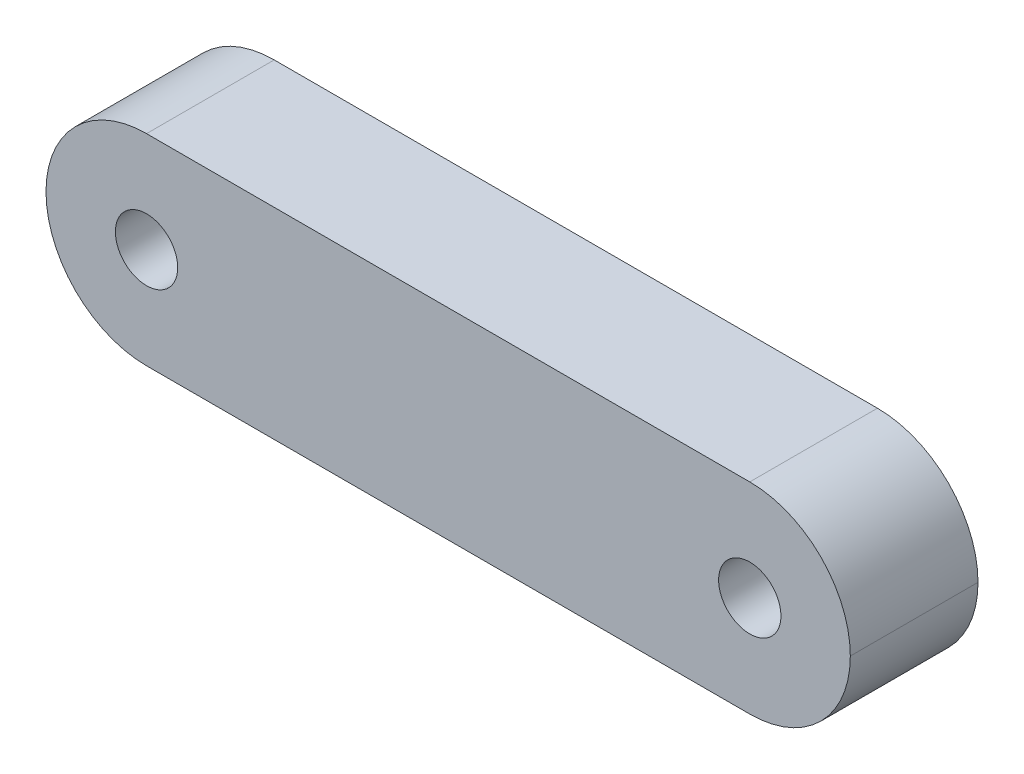
ISO-10303-21;
HEADER;
FILE_DESCRIPTION(('STEP AP214'),'2;1');
FILE_NAME('part.step','',(''),(''),'','','');
FILE_SCHEMA(('AUTOMOTIVE_DESIGN { 1 0 10303 214 1 1 1 1 }'));
ENDSEC;
DATA;
#1=APPLICATION_CONTEXT('core data for automotive mechanical design processes');
#2=APPLICATION_PROTOCOL_DEFINITION('international standard','automotive_design',2000,#1);
#3=PRODUCT_CONTEXT('',#1,'mechanical');
#4=PRODUCT('Part','Part','',(#3));
#5=PRODUCT_RELATED_PRODUCT_CATEGORY('part','',(#4));
#6=PRODUCT_DEFINITION_FORMATION('','',#4);
#7=PRODUCT_DEFINITION_CONTEXT('part definition',#1,'design');
#8=PRODUCT_DEFINITION('design','',#6,#7);
#9=PRODUCT_DEFINITION_SHAPE('','',#8);
#10=(LENGTH_UNIT() NAMED_UNIT(*) SI_UNIT(.MILLI.,.METRE.));
#11=(NAMED_UNIT(*) PLANE_ANGLE_UNIT() SI_UNIT($,.RADIAN.));
#12=(NAMED_UNIT(*) SI_UNIT($,.STERADIAN.) SOLID_ANGLE_UNIT());
#13=UNCERTAINTY_MEASURE_WITH_UNIT(LENGTH_MEASURE(1.E-05),#10,'distance_accuracy_value','');
#14=(GEOMETRIC_REPRESENTATION_CONTEXT(3) GLOBAL_UNCERTAINTY_ASSIGNED_CONTEXT((#13)) GLOBAL_UNIT_ASSIGNED_CONTEXT((#10,
#11,#12)) REPRESENTATION_CONTEXT('',''));
#15=CARTESIAN_POINT('',(0.,0.,0.));
#16=DIRECTION('',(0.,0.,1.));
#17=DIRECTION('',(1.,0.,0.));
#18=AXIS2_PLACEMENT_3D('',#15,#16,#17);
#19=CARTESIAN_POINT('',(0.,0.,6.35));
#20=DIRECTION('',(0.,1.,0.));
#21=DIRECTION('',(0.,0.,1.));
#22=AXIS2_PLACEMENT_3D('',#19,#20,#21);
#23=PLANE('',#22);
#24=DIRECTION('',(1.,0.,0.));
#25=VECTOR('',#24,1.);
#26=CARTESIAN_POINT('',(0.,0.,6.35));
#27=LINE('',#26,#25);
#28=CARTESIAN_POINT('',(5.,0.,6.35));
#29=VERTEX_POINT('',#28);
#30=CARTESIAN_POINT('',(35.,0.,6.35));
#31=VERTEX_POINT('',#30);
#32=EDGE_CURVE('E96',#29,#31,#27,.T.);
#33=ORIENTED_EDGE('',*,*,#32,.F.);
#34=DIRECTION('',(0.,0.,-1.));
#35=VECTOR('',#34,1.);
#36=CARTESIAN_POINT('',(5.,0.,0.));
#37=LINE('',#36,#35);
#38=CARTESIAN_POINT('',(5.,0.,0.));
#39=VERTEX_POINT('',#38);
#40=EDGE_CURVE('E11',#29,#39,#37,.T.);
#41=ORIENTED_EDGE('',*,*,#40,.T.);
#42=DIRECTION('',(1.,0.,0.));
#43=VECTOR('',#42,1.);
#44=CARTESIAN_POINT('',(0.,0.,0.));
#45=LINE('',#44,#43);
#46=CARTESIAN_POINT('',(35.,0.,0.));
#47=VERTEX_POINT('',#46);
#48=EDGE_CURVE('E94',#39,#47,#45,.T.);
#49=ORIENTED_EDGE('',*,*,#48,.T.);
#50=DIRECTION('',(0.,0.,-1.));
#51=VECTOR('',#50,1.);
#52=CARTESIAN_POINT('',(35.,0.,6.35));
#53=LINE('',#52,#51);
#54=EDGE_CURVE('E47',#47,#31,#53,.F.);
#55=ORIENTED_EDGE('',*,*,#54,.T.);
#56=EDGE_LOOP('',(#33,#41,#49,#55));
#57=FACE_BOUND('',#56,.T.);
#58=ADVANCED_FACE('F38',(#57),#23,.F.);
#59=CARTESIAN_POINT('',(0.,10.,6.35));
#60=DIRECTION('',(0.,1.,0.));
#61=DIRECTION('',(0.,0.,1.));
#62=AXIS2_PLACEMENT_3D('',#59,#60,#61);
#63=PLANE('',#62);
#64=DIRECTION('',(1.,0.,0.));
#65=VECTOR('',#64,1.);
#66=CARTESIAN_POINT('',(0.,10.,0.));
#67=LINE('',#66,#65);
#68=CARTESIAN_POINT('',(5.,10.,0.));
#69=VERTEX_POINT('',#68);
#70=CARTESIAN_POINT('',(35.,10.,0.));
#71=VERTEX_POINT('',#70);
#72=EDGE_CURVE('E105',#69,#71,#67,.T.);
#73=ORIENTED_EDGE('',*,*,#72,.F.);
#74=DIRECTION('',(0.,0.,-1.));
#75=VECTOR('',#74,1.);
#76=CARTESIAN_POINT('',(5.,10.,6.35));
#77=LINE('',#76,#75);
#78=CARTESIAN_POINT('',(5.,10.,6.35));
#79=VERTEX_POINT('',#78);
#80=EDGE_CURVE('E122',#69,#79,#77,.F.);
#81=ORIENTED_EDGE('',*,*,#80,.T.);
#82=DIRECTION('',(1.,0.,0.));
#83=VECTOR('',#82,1.);
#84=CARTESIAN_POINT('',(0.,10.,6.35));
#85=LINE('',#84,#83);
#86=CARTESIAN_POINT('',(35.,10.,6.35));
#87=VERTEX_POINT('',#86);
#88=EDGE_CURVE('E141',#79,#87,#85,.T.);
#89=ORIENTED_EDGE('',*,*,#88,.T.);
#90=DIRECTION('',(0.,0.,-1.));
#91=VECTOR('',#90,1.);
#92=CARTESIAN_POINT('',(35.,10.,0.));
#93=LINE('',#92,#91);
#94=EDGE_CURVE('E115',#87,#71,#93,.T.);
#95=ORIENTED_EDGE('',*,*,#94,.T.);
#96=EDGE_LOOP('',(#73,#81,#89,#95));
#97=FACE_BOUND('',#96,.T.);
#98=ADVANCED_FACE('F167',(#97),#63,.T.);
#99=CARTESIAN_POINT('',(35.,5.,6.35));
#100=DIRECTION('',(0.,0.,-1.));
#101=DIRECTION('',(-1.,0.,0.));
#102=AXIS2_PLACEMENT_3D('',#99,#100,#101);
#103=CYLINDRICAL_SURFACE('',#102,1.55);
#104=CARTESIAN_POINT('',(35.,5.,6.35));
#105=DIRECTION('',(0.,0.,1.));
#106=DIRECTION('',(1.,0.,0.));
#107=AXIS2_PLACEMENT_3D('',#104,#105,#106);
#108=CIRCLE('',#107,1.55);
#109=CARTESIAN_POINT('',(36.55,5.,6.35));
#110=VERTEX_POINT('',#109);
#111=EDGE_CURVE('E151',#110,#110,#108,.T.);
#112=ORIENTED_EDGE('',*,*,#111,.T.);
#113=EDGE_LOOP('',(#112));
#114=FACE_BOUND('',#113,.T.);
#115=CARTESIAN_POINT('',(35.,5.,0.));
#116=DIRECTION('',(0.,0.,1.));
#117=DIRECTION('',(1.,0.,0.));
#118=AXIS2_PLACEMENT_3D('',#115,#116,#117);
#119=CIRCLE('',#118,1.55);
#120=CARTESIAN_POINT('',(36.55,5.,0.));
#121=VERTEX_POINT('',#120);
#122=EDGE_CURVE('E106',#121,#121,#119,.T.);
#123=ORIENTED_EDGE('',*,*,#122,.F.);
#124=EDGE_LOOP('',(#123));
#125=FACE_BOUND('',#124,.T.);
#126=ADVANCED_FACE('F183',(#114,#125),#103,.F.);
#127=CARTESIAN_POINT('',(5.,5.,6.35));
#128=DIRECTION('',(0.,0.,-1.));
#129=DIRECTION('',(-1.,0.,0.));
#130=AXIS2_PLACEMENT_3D('',#127,#128,#129);
#131=CYLINDRICAL_SURFACE('',#130,1.55);
#132=CARTESIAN_POINT('',(5.,5.,6.35));
#133=DIRECTION('',(0.,0.,1.));
#134=DIRECTION('',(1.,0.,0.));
#135=AXIS2_PLACEMENT_3D('',#132,#133,#134);
#136=CIRCLE('',#135,1.55);
#137=CARTESIAN_POINT('',(6.55,5.,6.35));
#138=VERTEX_POINT('',#137);
#139=EDGE_CURVE('E146',#138,#138,#136,.T.);
#140=ORIENTED_EDGE('',*,*,#139,.T.);
#141=EDGE_LOOP('',(#140));
#142=FACE_BOUND('',#141,.T.);
#143=CARTESIAN_POINT('',(5.,5.,0.));
#144=DIRECTION('',(0.,0.,1.));
#145=DIRECTION('',(1.,0.,0.));
#146=AXIS2_PLACEMENT_3D('',#143,#144,#145);
#147=CIRCLE('',#146,1.55);
#148=CARTESIAN_POINT('',(6.55,5.,0.));
#149=VERTEX_POINT('',#148);
#150=EDGE_CURVE('E131',#149,#149,#147,.T.);
#151=ORIENTED_EDGE('',*,*,#150,.F.);
#152=EDGE_LOOP('',(#151));
#153=FACE_BOUND('',#152,.T.);
#154=ADVANCED_FACE('F157',(#142,#153),#131,.F.);
#155=CARTESIAN_POINT('',(0.,0.,6.35));
#156=DIRECTION('',(0.,0.,1.));
#157=DIRECTION('',(1.,0.,0.));
#158=AXIS2_PLACEMENT_3D('',#155,#156,#157);
#159=PLANE('',#158);
#160=ORIENTED_EDGE('',*,*,#139,.F.);
#161=EDGE_LOOP('',(#160));
#162=FACE_BOUND('',#161,.T.);
#163=ORIENTED_EDGE('',*,*,#111,.F.);
#164=EDGE_LOOP('',(#163));
#165=FACE_BOUND('',#164,.T.);
#166=ORIENTED_EDGE('',*,*,#88,.F.);
#167=CARTESIAN_POINT('',(5.,5.,6.35));
#168=DIRECTION('',(0.,0.,1.));
#169=DIRECTION('',(1.,0.,0.));
#170=AXIS2_PLACEMENT_3D('',#167,#168,#169);
#171=CIRCLE('',#170,5.);
#172=CARTESIAN_POINT('',(0.,5.,6.35));
#173=VERTEX_POINT('',#172);
#174=EDGE_CURVE('E55',#79,#173,#171,.T.);
#175=ORIENTED_EDGE('',*,*,#174,.T.);
#176=CARTESIAN_POINT('',(5.,5.,6.35));
#177=DIRECTION('',(0.,0.,1.));
#178=DIRECTION('',(1.,0.,0.));
#179=AXIS2_PLACEMENT_3D('',#176,#177,#178);
#180=CIRCLE('',#179,5.);
#181=EDGE_CURVE('E128',#173,#29,#180,.T.);
#182=ORIENTED_EDGE('',*,*,#181,.T.);
#183=ORIENTED_EDGE('',*,*,#32,.T.);
#184=CARTESIAN_POINT('',(35.,5.,6.35));
#185=DIRECTION('',(0.,0.,1.));
#186=DIRECTION('',(1.,0.,0.));
#187=AXIS2_PLACEMENT_3D('',#184,#185,#186);
#188=CIRCLE('',#187,5.);
#189=CARTESIAN_POINT('',(40.,5.,6.35));
#190=VERTEX_POINT('',#189);
#191=EDGE_CURVE('E62',#31,#190,#188,.T.);
#192=ORIENTED_EDGE('',*,*,#191,.T.);
#193=CARTESIAN_POINT('',(35.,5.,6.35));
#194=DIRECTION('',(0.,0.,1.));
#195=DIRECTION('',(1.,0.,0.));
#196=AXIS2_PLACEMENT_3D('',#193,#194,#195);
#197=CIRCLE('',#196,5.);
#198=EDGE_CURVE('E126',#190,#87,#197,.T.);
#199=ORIENTED_EDGE('',*,*,#198,.T.);
#200=EDGE_LOOP('',(#166,#175,#182,#183,#192,#199));
#201=FACE_BOUND('',#200,.T.);
#202=ADVANCED_FACE('F160',(#162,#165,#201),#159,.T.);
#203=CARTESIAN_POINT('',(0.,0.,0.));
#204=DIRECTION('',(0.,0.,1.));
#205=DIRECTION('',(1.,0.,0.));
#206=AXIS2_PLACEMENT_3D('',#203,#204,#205);
#207=PLANE('',#206);
#208=ORIENTED_EDGE('',*,*,#150,.T.);
#209=EDGE_LOOP('',(#208));
#210=FACE_BOUND('',#209,.T.);
#211=ORIENTED_EDGE('',*,*,#122,.T.);
#212=EDGE_LOOP('',(#211));
#213=FACE_BOUND('',#212,.T.);
#214=CARTESIAN_POINT('',(5.,5.,0.));
#215=DIRECTION('',(0.,0.,1.));
#216=DIRECTION('',(1.,0.,0.));
#217=AXIS2_PLACEMENT_3D('',#214,#215,#216);
#218=CIRCLE('',#217,5.);
#219=CARTESIAN_POINT('',(0.,5.,0.));
#220=VERTEX_POINT('',#219);
#221=EDGE_CURVE('E101',#39,#220,#218,.F.);
#222=ORIENTED_EDGE('',*,*,#221,.T.);
#223=CARTESIAN_POINT('',(5.,5.,0.));
#224=DIRECTION('',(0.,0.,1.));
#225=DIRECTION('',(1.,0.,0.));
#226=AXIS2_PLACEMENT_3D('',#223,#224,#225);
#227=CIRCLE('',#226,5.);
#228=EDGE_CURVE('E112',#220,#69,#227,.F.);
#229=ORIENTED_EDGE('',*,*,#228,.T.);
#230=ORIENTED_EDGE('',*,*,#72,.T.);
#231=CARTESIAN_POINT('',(35.,5.,0.));
#232=DIRECTION('',(0.,0.,1.));
#233=DIRECTION('',(1.,0.,0.));
#234=AXIS2_PLACEMENT_3D('',#231,#232,#233);
#235=CIRCLE('',#234,5.);
#236=CARTESIAN_POINT('',(40.,5.,0.));
#237=VERTEX_POINT('',#236);
#238=EDGE_CURVE('E113',#71,#237,#235,.F.);
#239=ORIENTED_EDGE('',*,*,#238,.T.);
#240=CARTESIAN_POINT('',(35.,5.,0.));
#241=DIRECTION('',(0.,0.,1.));
#242=DIRECTION('',(1.,0.,0.));
#243=AXIS2_PLACEMENT_3D('',#240,#241,#242);
#244=CIRCLE('',#243,5.);
#245=EDGE_CURVE('E104',#237,#47,#244,.F.);
#246=ORIENTED_EDGE('',*,*,#245,.T.);
#247=ORIENTED_EDGE('',*,*,#48,.F.);
#248=EDGE_LOOP('',(#222,#229,#230,#239,#246,#247));
#249=FACE_BOUND('',#248,.T.);
#250=ADVANCED_FACE('F100',(#210,#213,#249),#207,.F.);
#251=CARTESIAN_POINT('',(5.,5.,6.35));
#252=DIRECTION('',(0.,0.,1.));
#253=DIRECTION('',(1.,0.,0.));
#254=AXIS2_PLACEMENT_3D('',#251,#252,#253);
#255=CYLINDRICAL_SURFACE('',#254,5.);
#256=ORIENTED_EDGE('',*,*,#40,.F.);
#257=ORIENTED_EDGE('',*,*,#181,.F.);
#258=DIRECTION('',(0.,0.,-1.));
#259=VECTOR('',#258,1.);
#260=CARTESIAN_POINT('',(0.,5.,6.35));
#261=LINE('',#260,#259);
#262=EDGE_CURVE('E110',#220,#173,#261,.F.);
#263=ORIENTED_EDGE('',*,*,#262,.F.);
#264=ORIENTED_EDGE('',*,*,#221,.F.);
#265=EDGE_LOOP('',(#256,#257,#263,#264));
#266=FACE_BOUND('',#265,.T.);
#267=ADVANCED_FACE('F108',(#266),#255,.T.);
#268=CARTESIAN_POINT('',(5.,5.,6.35));
#269=DIRECTION('',(0.,0.,-1.));
#270=DIRECTION('',(-1.,0.,0.));
#271=AXIS2_PLACEMENT_3D('',#268,#269,#270);
#272=CYLINDRICAL_SURFACE('',#271,5.);
#273=ORIENTED_EDGE('',*,*,#174,.F.);
#274=ORIENTED_EDGE('',*,*,#80,.F.);
#275=ORIENTED_EDGE('',*,*,#228,.F.);
#276=ORIENTED_EDGE('',*,*,#262,.T.);
#277=EDGE_LOOP('',(#273,#274,#275,#276));
#278=FACE_BOUND('',#277,.T.);
#279=ADVANCED_FACE('F169',(#278),#272,.T.);
#280=CARTESIAN_POINT('',(35.,5.,6.35));
#281=DIRECTION('',(0.,0.,-1.));
#282=DIRECTION('',(-1.,0.,0.));
#283=AXIS2_PLACEMENT_3D('',#280,#281,#282);
#284=CYLINDRICAL_SURFACE('',#283,5.);
#285=DIRECTION('',(0.,0.,-1.));
#286=VECTOR('',#285,1.);
#287=CARTESIAN_POINT('',(40.,5.,6.35));
#288=LINE('',#287,#286);
#289=EDGE_CURVE('E42',#190,#237,#288,.T.);
#290=ORIENTED_EDGE('',*,*,#289,.F.);
#291=ORIENTED_EDGE('',*,*,#191,.F.);
#292=ORIENTED_EDGE('',*,*,#54,.F.);
#293=ORIENTED_EDGE('',*,*,#245,.F.);
#294=EDGE_LOOP('',(#290,#291,#292,#293));
#295=FACE_BOUND('',#294,.T.);
#296=ADVANCED_FACE('F40',(#295),#284,.T.);
#297=CARTESIAN_POINT('',(35.,5.,6.35));
#298=DIRECTION('',(0.,0.,1.));
#299=DIRECTION('',(1.,0.,0.));
#300=AXIS2_PLACEMENT_3D('',#297,#298,#299);
#301=CYLINDRICAL_SURFACE('',#300,5.);
#302=ORIENTED_EDGE('',*,*,#198,.F.);
#303=ORIENTED_EDGE('',*,*,#289,.T.);
#304=ORIENTED_EDGE('',*,*,#238,.F.);
#305=ORIENTED_EDGE('',*,*,#94,.F.);
#306=EDGE_LOOP('',(#302,#303,#304,#305));
#307=FACE_BOUND('',#306,.T.);
#308=ADVANCED_FACE('F138',(#307),#301,.T.);
#309=CLOSED_SHELL('',(#58,#98,#126,#154,#202,#250,#267,#279,#296,#308));
#310=MANIFOLD_SOLID_BREP('B2',#309);
#311=ADVANCED_BREP_SHAPE_REPRESENTATION('',(#18,#310),#14);
#312=SHAPE_DEFINITION_REPRESENTATION(#9,#311);
ENDSEC;
END-ISO-10303-21;
